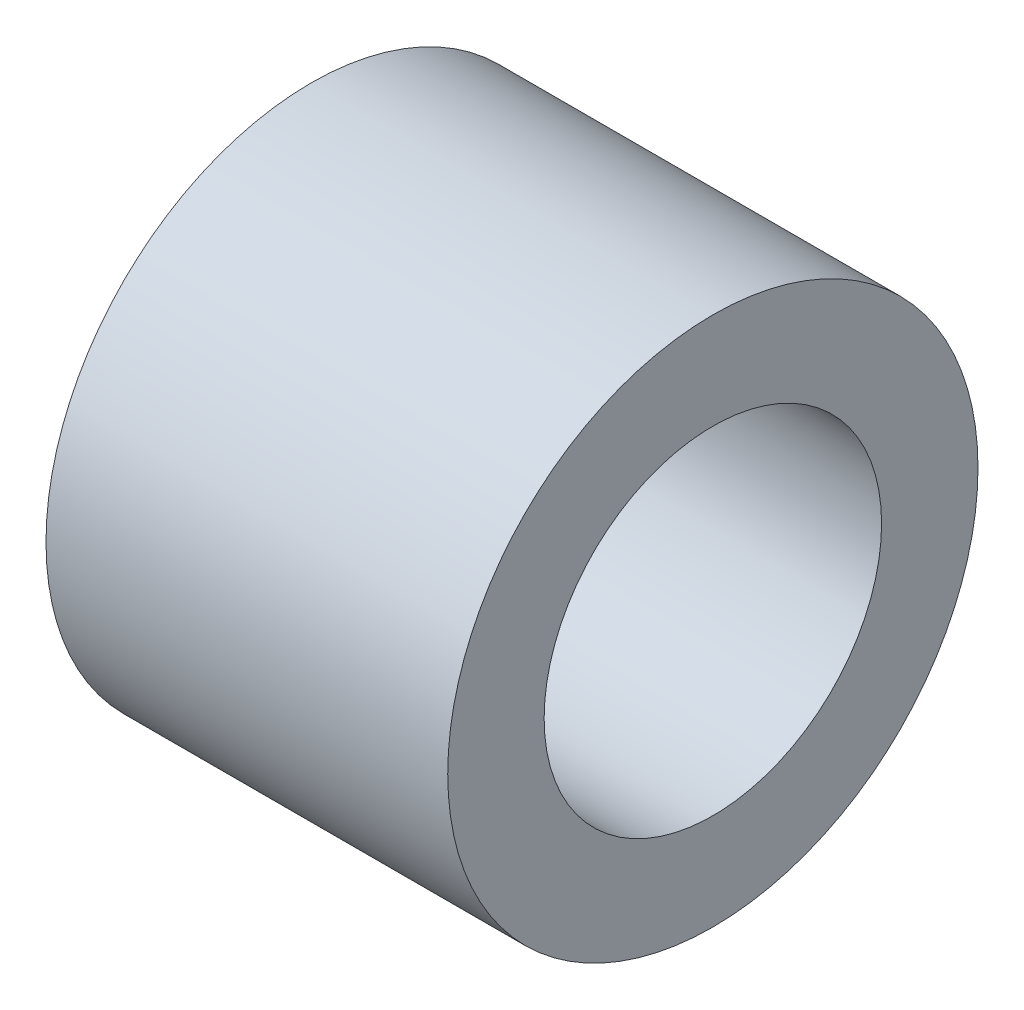
ISO-10303-21;
HEADER;
FILE_DESCRIPTION(('STEP AP214'),'2;1');
FILE_NAME('part.step','',(''),(''),'','','');
FILE_SCHEMA(('AUTOMOTIVE_DESIGN { 1 0 10303 214 1 1 1 1 }'));
ENDSEC;
DATA;
#1=APPLICATION_CONTEXT('core data for automotive mechanical design processes');
#2=APPLICATION_PROTOCOL_DEFINITION('international standard','automotive_design',2000,#1);
#3=PRODUCT_CONTEXT('',#1,'mechanical');
#4=PRODUCT('Part','Part','',(#3));
#5=PRODUCT_RELATED_PRODUCT_CATEGORY('part','',(#4));
#6=PRODUCT_DEFINITION_FORMATION('','',#4);
#7=PRODUCT_DEFINITION_CONTEXT('part definition',#1,'design');
#8=PRODUCT_DEFINITION('design','',#6,#7);
#9=PRODUCT_DEFINITION_SHAPE('','',#8);
#10=(LENGTH_UNIT() NAMED_UNIT(*) SI_UNIT(.MILLI.,.METRE.));
#11=(NAMED_UNIT(*) PLANE_ANGLE_UNIT() SI_UNIT($,.RADIAN.));
#12=(NAMED_UNIT(*) SI_UNIT($,.STERADIAN.) SOLID_ANGLE_UNIT());
#13=UNCERTAINTY_MEASURE_WITH_UNIT(LENGTH_MEASURE(1.E-05),#10,'distance_accuracy_value','');
#14=(GEOMETRIC_REPRESENTATION_CONTEXT(3) GLOBAL_UNCERTAINTY_ASSIGNED_CONTEXT((#13)) GLOBAL_UNIT_ASSIGNED_CONTEXT((#10,
#11,#12)) REPRESENTATION_CONTEXT('',''));
#15=CARTESIAN_POINT('',(0.,0.,0.));
#16=DIRECTION('',(0.,0.,1.));
#17=DIRECTION('',(1.,0.,0.));
#18=AXIS2_PLACEMENT_3D('',#15,#16,#17);
#19=CARTESIAN_POINT('',(5.,0.,0.));
#20=DIRECTION('',(1.,0.,0.));
#21=DIRECTION('',(0.,0.,-1.));
#22=AXIS2_PLACEMENT_3D('',#19,#20,#21);
#23=PLANE('',#22);
#24=CARTESIAN_POINT('',(5.,0.,0.));
#25=DIRECTION('',(1.,0.,0.));
#26=DIRECTION('',(0.,0.,-1.));
#27=AXIS2_PLACEMENT_3D('',#24,#25,#26);
#28=CIRCLE('',#27,3.3);
#29=CARTESIAN_POINT('',(5.,0.,-3.3));
#30=VERTEX_POINT('',#29);
#31=EDGE_CURVE('E10',#30,#30,#28,.T.);
#32=ORIENTED_EDGE('',*,*,#31,.T.);
#33=EDGE_LOOP('',(#32));
#34=FACE_BOUND('',#33,.T.);
#35=CARTESIAN_POINT('',(5.,0.,0.));
#36=DIRECTION('',(1.,0.,0.));
#37=DIRECTION('',(0.,0.,-1.));
#38=AXIS2_PLACEMENT_3D('',#35,#36,#37);
#39=CIRCLE('',#38,2.1);
#40=CARTESIAN_POINT('',(5.,0.,-2.1));
#41=VERTEX_POINT('',#40);
#42=EDGE_CURVE('E44',#41,#41,#39,.T.);
#43=ORIENTED_EDGE('',*,*,#42,.F.);
#44=EDGE_LOOP('',(#43));
#45=FACE_BOUND('',#44,.T.);
#46=ADVANCED_FACE('F33',(#34,#45),#23,.T.);
#47=CARTESIAN_POINT('',(0.,0.,0.));
#48=DIRECTION('',(1.,0.,0.));
#49=DIRECTION('',(0.,0.,-1.));
#50=AXIS2_PLACEMENT_3D('',#47,#48,#49);
#51=PLANE('',#50);
#52=CARTESIAN_POINT('',(0.,0.,0.));
#53=DIRECTION('',(1.,0.,0.));
#54=DIRECTION('',(0.,0.,-1.));
#55=AXIS2_PLACEMENT_3D('',#52,#53,#54);
#56=CIRCLE('',#55,3.3);
#57=CARTESIAN_POINT('',(0.,0.,-3.3));
#58=VERTEX_POINT('',#57);
#59=EDGE_CURVE('E37',#58,#58,#56,.T.);
#60=ORIENTED_EDGE('',*,*,#59,.F.);
#61=EDGE_LOOP('',(#60));
#62=FACE_BOUND('',#61,.T.);
#63=CARTESIAN_POINT('',(0.,0.,0.));
#64=DIRECTION('',(1.,0.,0.));
#65=DIRECTION('',(0.,0.,-1.));
#66=AXIS2_PLACEMENT_3D('',#63,#64,#65);
#67=CIRCLE('',#66,2.1);
#68=CARTESIAN_POINT('',(0.,0.,-2.1));
#69=VERTEX_POINT('',#68);
#70=EDGE_CURVE('E46',#69,#69,#67,.T.);
#71=ORIENTED_EDGE('',*,*,#70,.T.);
#72=EDGE_LOOP('',(#71));
#73=FACE_BOUND('',#72,.T.);
#74=ADVANCED_FACE('F56',(#62,#73),#51,.F.);
#75=CARTESIAN_POINT('',(5.,0.,0.));
#76=DIRECTION('',(-1.,0.,0.));
#77=DIRECTION('',(0.,0.,1.));
#78=AXIS2_PLACEMENT_3D('',#75,#76,#77);
#79=CYLINDRICAL_SURFACE('',#78,3.3);
#80=ORIENTED_EDGE('',*,*,#31,.F.);
#81=EDGE_LOOP('',(#80));
#82=FACE_BOUND('',#81,.T.);
#83=ORIENTED_EDGE('',*,*,#59,.T.);
#84=EDGE_LOOP('',(#83));
#85=FACE_BOUND('',#84,.T.);
#86=ADVANCED_FACE('F35',(#82,#85),#79,.T.);
#87=CARTESIAN_POINT('',(5.,0.,0.));
#88=DIRECTION('',(-1.,0.,0.));
#89=DIRECTION('',(0.,0.,1.));
#90=AXIS2_PLACEMENT_3D('',#87,#88,#89);
#91=CYLINDRICAL_SURFACE('',#90,2.1);
#92=ORIENTED_EDGE('',*,*,#42,.T.);
#93=EDGE_LOOP('',(#92));
#94=FACE_BOUND('',#93,.T.);
#95=ORIENTED_EDGE('',*,*,#70,.F.);
#96=EDGE_LOOP('',(#95));
#97=FACE_BOUND('',#96,.T.);
#98=ADVANCED_FACE('F52',(#94,#97),#91,.F.);
#99=CLOSED_SHELL('',(#46,#74,#86,#98));
#100=MANIFOLD_SOLID_BREP('B2',#99);
#101=ADVANCED_BREP_SHAPE_REPRESENTATION('',(#18,#100),#14);
#102=SHAPE_DEFINITION_REPRESENTATION(#9,#101);
ENDSEC;
END-ISO-10303-21;
